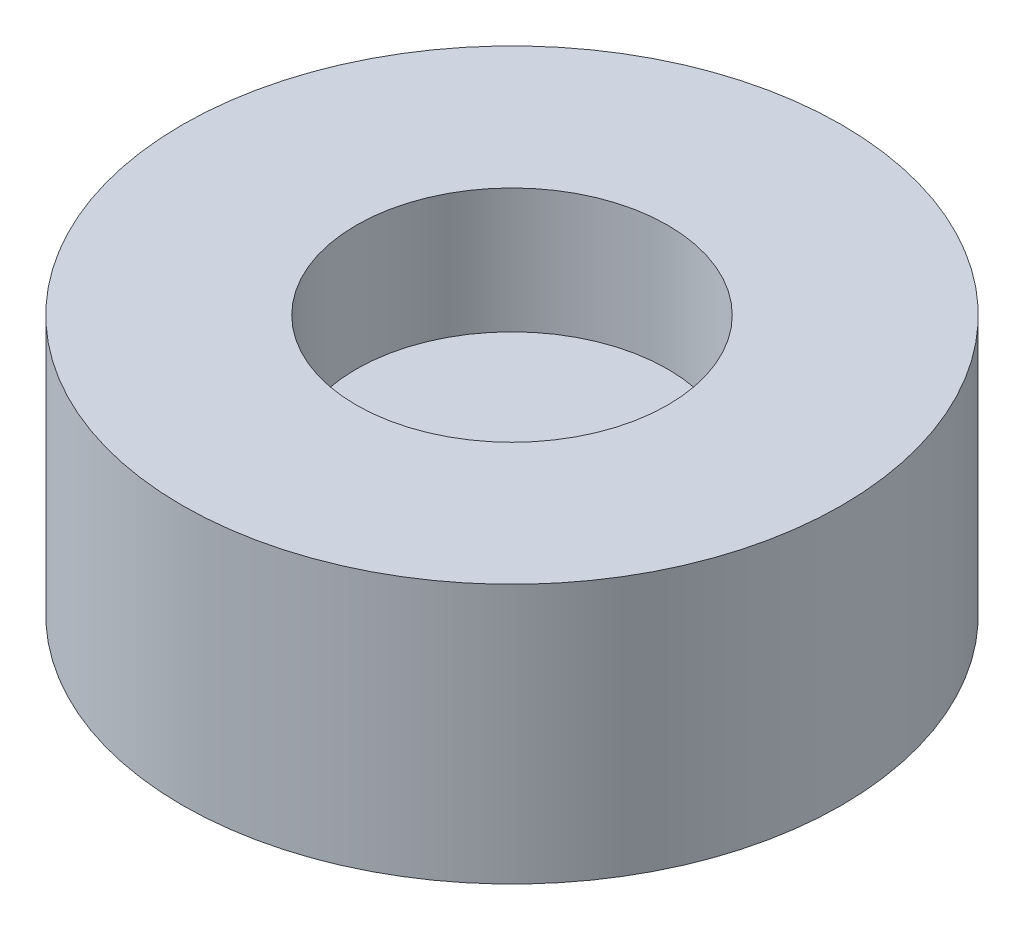
ISO-10303-21;
HEADER;
FILE_DESCRIPTION(('STEP AP214'),'2;1');
FILE_NAME('part.step','',(''),(''),'','','');
FILE_SCHEMA(('AUTOMOTIVE_DESIGN { 1 0 10303 214 1 1 1 1 }'));
ENDSEC;
DATA;
#1=APPLICATION_CONTEXT('core data for automotive mechanical design processes');
#2=APPLICATION_PROTOCOL_DEFINITION('international standard','automotive_design',2000,#1);
#3=PRODUCT_CONTEXT('',#1,'mechanical');
#4=PRODUCT('Part','Part','',(#3));
#5=PRODUCT_RELATED_PRODUCT_CATEGORY('part','',(#4));
#6=PRODUCT_DEFINITION_FORMATION('','',#4);
#7=PRODUCT_DEFINITION_CONTEXT('part definition',#1,'design');
#8=PRODUCT_DEFINITION('design','',#6,#7);
#9=PRODUCT_DEFINITION_SHAPE('','',#8);
#10=(LENGTH_UNIT() NAMED_UNIT(*) SI_UNIT(.MILLI.,.METRE.));
#11=(NAMED_UNIT(*) PLANE_ANGLE_UNIT() SI_UNIT($,.RADIAN.));
#12=(NAMED_UNIT(*) SI_UNIT($,.STERADIAN.) SOLID_ANGLE_UNIT());
#13=UNCERTAINTY_MEASURE_WITH_UNIT(LENGTH_MEASURE(1.E-05),#10,'distance_accuracy_value','');
#14=(GEOMETRIC_REPRESENTATION_CONTEXT(3) GLOBAL_UNCERTAINTY_ASSIGNED_CONTEXT((#13)) GLOBAL_UNIT_ASSIGNED_CONTEXT((#10,
#11,#12)) REPRESENTATION_CONTEXT('',''));
#15=CARTESIAN_POINT('',(0.,0.,0.));
#16=DIRECTION('',(0.,0.,1.));
#17=DIRECTION('',(1.,0.,0.));
#18=AXIS2_PLACEMENT_3D('',#15,#16,#17);
#19=CARTESIAN_POINT('',(0.,5.,0.));
#20=DIRECTION('',(0.,-1.,0.));
#21=DIRECTION('',(0.,0.,-1.));
#22=AXIS2_PLACEMENT_3D('',#19,#20,#21);
#23=CYLINDRICAL_SURFACE('',#22,6.35);
#24=CARTESIAN_POINT('',(0.,5.,0.));
#25=DIRECTION('',(0.,1.,0.));
#26=DIRECTION('',(0.,0.,1.));
#27=AXIS2_PLACEMENT_3D('',#24,#25,#26);
#28=CIRCLE('',#27,6.35);
#29=CARTESIAN_POINT('',(0.,5.,6.35));
#30=VERTEX_POINT('',#29);
#31=EDGE_CURVE('E10',#30,#30,#28,.T.);
#32=ORIENTED_EDGE('',*,*,#31,.F.);
#33=EDGE_LOOP('',(#32));
#34=FACE_BOUND('',#33,.T.);
#35=CARTESIAN_POINT('',(0.,0.,0.));
#36=DIRECTION('',(0.,1.,0.));
#37=DIRECTION('',(0.,0.,1.));
#38=AXIS2_PLACEMENT_3D('',#35,#36,#37);
#39=CIRCLE('',#38,6.35);
#40=CARTESIAN_POINT('',(0.,0.,6.35));
#41=VERTEX_POINT('',#40);
#42=EDGE_CURVE('E40',#41,#41,#39,.T.);
#43=ORIENTED_EDGE('',*,*,#42,.T.);
#44=EDGE_LOOP('',(#43));
#45=FACE_BOUND('',#44,.T.);
#46=ADVANCED_FACE('F37',(#34,#45),#23,.T.);
#47=CARTESIAN_POINT('',(0.,5.,0.));
#48=DIRECTION('',(0.,1.,0.));
#49=DIRECTION('',(0.,0.,1.));
#50=AXIS2_PLACEMENT_3D('',#47,#48,#49);
#51=PLANE('',#50);
#52=CARTESIAN_POINT('',(0.,5.,0.));
#53=DIRECTION('',(0.,1.,0.));
#54=DIRECTION('',(0.,0.,1.));
#55=AXIS2_PLACEMENT_3D('',#52,#53,#54);
#56=CIRCLE('',#55,3.);
#57=CARTESIAN_POINT('',(0.,5.,3.));
#58=VERTEX_POINT('',#57);
#59=EDGE_CURVE('E51',#58,#58,#56,.T.);
#60=ORIENTED_EDGE('',*,*,#59,.F.);
#61=EDGE_LOOP('',(#60));
#62=FACE_BOUND('',#61,.T.);
#63=ORIENTED_EDGE('',*,*,#31,.T.);
#64=EDGE_LOOP('',(#63));
#65=FACE_BOUND('',#64,.T.);
#66=ADVANCED_FACE('F68',(#62,#65),#51,.T.);
#67=CARTESIAN_POINT('',(0.,0.,0.));
#68=DIRECTION('',(0.,1.,0.));
#69=DIRECTION('',(0.,0.,1.));
#70=AXIS2_PLACEMENT_3D('',#67,#68,#69);
#71=PLANE('',#70);
#72=ORIENTED_EDGE('',*,*,#42,.F.);
#73=EDGE_LOOP('',(#72));
#74=FACE_BOUND('',#73,.T.);
#75=ADVANCED_FACE('F64',(#74),#71,.F.);
#76=CARTESIAN_POINT('',(0.,2.6,0.));
#77=DIRECTION('',(0.,1.,0.));
#78=DIRECTION('',(0.,0.,1.));
#79=AXIS2_PLACEMENT_3D('',#76,#77,#78);
#80=CYLINDRICAL_SURFACE('',#79,3.);
#81=CARTESIAN_POINT('',(0.,2.6,0.));
#82=DIRECTION('',(0.,1.,0.));
#83=DIRECTION('',(0.,0.,1.));
#84=AXIS2_PLACEMENT_3D('',#81,#82,#83);
#85=CIRCLE('',#84,3.);
#86=CARTESIAN_POINT('',(0.,2.6,3.));
#87=VERTEX_POINT('',#86);
#88=EDGE_CURVE('E49',#87,#87,#85,.T.);
#89=ORIENTED_EDGE('',*,*,#88,.F.);
#90=EDGE_LOOP('',(#89));
#91=FACE_BOUND('',#90,.T.);
#92=ORIENTED_EDGE('',*,*,#59,.T.);
#93=EDGE_LOOP('',(#92));
#94=FACE_BOUND('',#93,.T.);
#95=ADVANCED_FACE('F61',(#91,#94),#80,.F.);
#96=CARTESIAN_POINT('',(0.,2.6,0.));
#97=DIRECTION('',(0.,1.,0.));
#98=DIRECTION('',(0.,0.,1.));
#99=AXIS2_PLACEMENT_3D('',#96,#97,#98);
#100=PLANE('',#99);
#101=ORIENTED_EDGE('',*,*,#88,.T.);
#102=EDGE_LOOP('',(#101));
#103=FACE_BOUND('',#102,.T.);
#104=ADVANCED_FACE('F59',(#103),#100,.T.);
#105=CLOSED_SHELL('',(#46,#66,#75,#95,#104));
#106=MANIFOLD_SOLID_BREP('B2',#105);
#107=ADVANCED_BREP_SHAPE_REPRESENTATION('',(#18,#106),#14);
#108=SHAPE_DEFINITION_REPRESENTATION(#9,#107);
ENDSEC;
END-ISO-10303-21;
